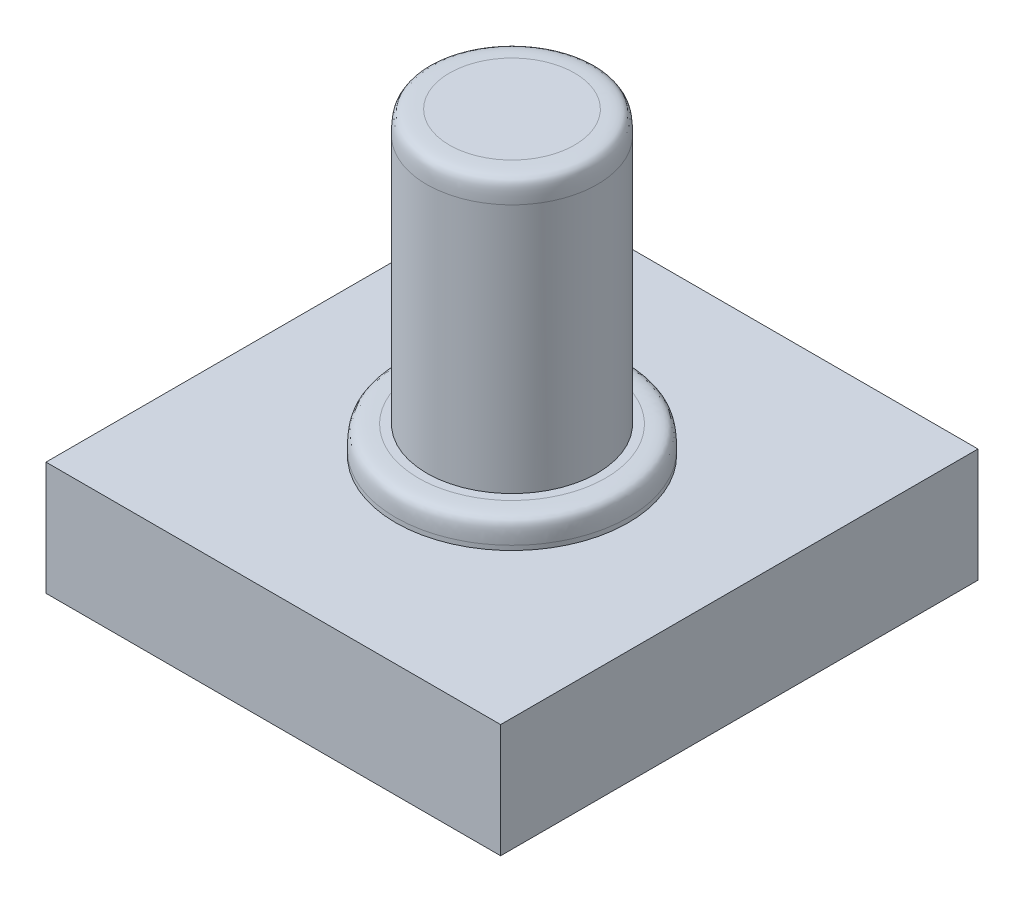
ISO-10303-21;
HEADER;
FILE_DESCRIPTION(('STEP AP214'),'2;1');
FILE_NAME('part.step','',(''),(''),'','','');
FILE_SCHEMA(('AUTOMOTIVE_DESIGN { 1 0 10303 214 1 1 1 1 }'));
ENDSEC;
DATA;
#1=APPLICATION_CONTEXT('core data for automotive mechanical design processes');
#2=APPLICATION_PROTOCOL_DEFINITION('international standard','automotive_design',2000,#1);
#3=PRODUCT_CONTEXT('',#1,'mechanical');
#4=PRODUCT('Part','Part','',(#3));
#5=PRODUCT_RELATED_PRODUCT_CATEGORY('part','',(#4));
#6=PRODUCT_DEFINITION_FORMATION('','',#4);
#7=PRODUCT_DEFINITION_CONTEXT('part definition',#1,'design');
#8=PRODUCT_DEFINITION('design','',#6,#7);
#9=PRODUCT_DEFINITION_SHAPE('','',#8);
#10=(LENGTH_UNIT() NAMED_UNIT(*) SI_UNIT(.MILLI.,.METRE.));
#11=(NAMED_UNIT(*) PLANE_ANGLE_UNIT() SI_UNIT($,.RADIAN.));
#12=(NAMED_UNIT(*) SI_UNIT($,.STERADIAN.) SOLID_ANGLE_UNIT());
#13=UNCERTAINTY_MEASURE_WITH_UNIT(LENGTH_MEASURE(1.E-05),#10,'distance_accuracy_value','');
#14=(GEOMETRIC_REPRESENTATION_CONTEXT(3) GLOBAL_UNCERTAINTY_ASSIGNED_CONTEXT((#13)) GLOBAL_UNIT_ASSIGNED_CONTEXT((#10,
#11,#12)) REPRESENTATION_CONTEXT('',''));
#15=CARTESIAN_POINT('',(0.,0.,0.));
#16=DIRECTION('',(0.,0.,1.));
#17=DIRECTION('',(1.,0.,0.));
#18=AXIS2_PLACEMENT_3D('',#15,#16,#17);
#19=CARTESIAN_POINT('',(-5.,2.5,-5.25));
#20=DIRECTION('',(1.,0.,0.));
#21=DIRECTION('',(0.,0.,-1.));
#22=AXIS2_PLACEMENT_3D('',#19,#20,#21);
#23=PLANE('',#22);
#24=DIRECTION('',(0.,0.,1.));
#25=VECTOR('',#24,1.);
#26=CARTESIAN_POINT('',(-5.,0.,-5.25));
#27=LINE('',#26,#25);
#28=CARTESIAN_POINT('',(-5.,0.,-5.25));
#29=VERTEX_POINT('',#28);
#30=CARTESIAN_POINT('',(-5.,0.,5.25));
#31=VERTEX_POINT('',#30);
#32=EDGE_CURVE('E116',#29,#31,#27,.T.);
#33=ORIENTED_EDGE('',*,*,#32,.T.);
#34=DIRECTION('',(0.,-1.,0.));
#35=VECTOR('',#34,1.);
#36=CARTESIAN_POINT('',(-5.,2.5,5.25));
#37=LINE('',#36,#35);
#38=CARTESIAN_POINT('',(-5.,2.5,5.25));
#39=VERTEX_POINT('',#38);
#40=EDGE_CURVE('E108',#39,#31,#37,.T.);
#41=ORIENTED_EDGE('',*,*,#40,.F.);
#42=DIRECTION('',(0.,0.,1.));
#43=VECTOR('',#42,1.);
#44=CARTESIAN_POINT('',(-5.,2.5,-5.25));
#45=LINE('',#44,#43);
#46=CARTESIAN_POINT('',(-5.,2.5,-5.25));
#47=VERTEX_POINT('',#46);
#48=EDGE_CURVE('E99',#47,#39,#45,.T.);
#49=ORIENTED_EDGE('',*,*,#48,.F.);
#50=DIRECTION('',(0.,-1.,0.));
#51=VECTOR('',#50,1.);
#52=CARTESIAN_POINT('',(-5.,2.5,-5.25));
#53=LINE('',#52,#51);
#54=EDGE_CURVE('E65',#47,#29,#53,.T.);
#55=ORIENTED_EDGE('',*,*,#54,.T.);
#56=EDGE_LOOP('',(#33,#41,#49,#55));
#57=FACE_BOUND('',#56,.T.);
#58=ADVANCED_FACE('F42',(#57),#23,.F.);
#59=CARTESIAN_POINT('',(-5.,2.5,5.25));
#60=DIRECTION('',(0.,0.,-1.));
#61=DIRECTION('',(-1.,0.,0.));
#62=AXIS2_PLACEMENT_3D('',#59,#60,#61);
#63=PLANE('',#62);
#64=DIRECTION('',(1.,0.,0.));
#65=VECTOR('',#64,1.);
#66=CARTESIAN_POINT('',(-5.,0.,5.25));
#67=LINE('',#66,#65);
#68=CARTESIAN_POINT('',(5.,0.,5.25));
#69=VERTEX_POINT('',#68);
#70=EDGE_CURVE('E105',#31,#69,#67,.T.);
#71=ORIENTED_EDGE('',*,*,#70,.T.);
#72=DIRECTION('',(0.,-1.,0.));
#73=VECTOR('',#72,1.);
#74=CARTESIAN_POINT('',(5.,2.5,5.25));
#75=LINE('',#74,#73);
#76=CARTESIAN_POINT('',(5.,2.5,5.25));
#77=VERTEX_POINT('',#76);
#78=EDGE_CURVE('E103',#77,#69,#75,.T.);
#79=ORIENTED_EDGE('',*,*,#78,.F.);
#80=DIRECTION('',(1.,0.,0.));
#81=VECTOR('',#80,1.);
#82=CARTESIAN_POINT('',(-5.,2.5,5.25));
#83=LINE('',#82,#81);
#84=EDGE_CURVE('E91',#39,#77,#83,.T.);
#85=ORIENTED_EDGE('',*,*,#84,.F.);
#86=ORIENTED_EDGE('',*,*,#40,.T.);
#87=EDGE_LOOP('',(#71,#79,#85,#86));
#88=FACE_BOUND('',#87,.T.);
#89=ADVANCED_FACE('F104',(#88),#63,.F.);
#90=CARTESIAN_POINT('',(5.,2.5,-5.25));
#91=DIRECTION('',(1.,0.,0.));
#92=DIRECTION('',(0.,0.,-1.));
#93=AXIS2_PLACEMENT_3D('',#90,#91,#92);
#94=PLANE('',#93);
#95=DIRECTION('',(0.,0.,1.));
#96=VECTOR('',#95,1.);
#97=CARTESIAN_POINT('',(5.,0.,-5.25));
#98=LINE('',#97,#96);
#99=CARTESIAN_POINT('',(5.,0.,-5.25));
#100=VERTEX_POINT('',#99);
#101=EDGE_CURVE('E120',#100,#69,#98,.T.);
#102=ORIENTED_EDGE('',*,*,#101,.F.);
#103=DIRECTION('',(0.,-1.,0.));
#104=VECTOR('',#103,1.);
#105=CARTESIAN_POINT('',(5.,2.5,-5.25));
#106=LINE('',#105,#104);
#107=CARTESIAN_POINT('',(5.,2.5,-5.25));
#108=VERTEX_POINT('',#107);
#109=EDGE_CURVE('E79',#108,#100,#106,.T.);
#110=ORIENTED_EDGE('',*,*,#109,.F.);
#111=DIRECTION('',(0.,0.,1.));
#112=VECTOR('',#111,1.);
#113=CARTESIAN_POINT('',(5.,2.5,-5.25));
#114=LINE('',#113,#112);
#115=EDGE_CURVE('E98',#108,#77,#114,.T.);
#116=ORIENTED_EDGE('',*,*,#115,.T.);
#117=ORIENTED_EDGE('',*,*,#78,.T.);
#118=EDGE_LOOP('',(#102,#110,#116,#117));
#119=FACE_BOUND('',#118,.T.);
#120=ADVANCED_FACE('F110',(#119),#94,.T.);
#121=CARTESIAN_POINT('',(-5.,2.5,-5.25));
#122=DIRECTION('',(0.,0.,-1.));
#123=DIRECTION('',(-1.,0.,0.));
#124=AXIS2_PLACEMENT_3D('',#121,#122,#123);
#125=PLANE('',#124);
#126=DIRECTION('',(1.,0.,0.));
#127=VECTOR('',#126,1.);
#128=CARTESIAN_POINT('',(-5.,0.,-5.25));
#129=LINE('',#128,#127);
#130=EDGE_CURVE('E122',#29,#100,#129,.T.);
#131=ORIENTED_EDGE('',*,*,#130,.F.);
#132=ORIENTED_EDGE('',*,*,#54,.F.);
#133=DIRECTION('',(1.,0.,0.));
#134=VECTOR('',#133,1.);
#135=CARTESIAN_POINT('',(-5.,2.5,-5.25));
#136=LINE('',#135,#134);
#137=EDGE_CURVE('E111',#47,#108,#136,.T.);
#138=ORIENTED_EDGE('',*,*,#137,.T.);
#139=ORIENTED_EDGE('',*,*,#109,.T.);
#140=EDGE_LOOP('',(#131,#132,#138,#139));
#141=FACE_BOUND('',#140,.T.);
#142=ADVANCED_FACE('F270',(#141),#125,.T.);
#143=CARTESIAN_POINT('',(0.,2.5,0.));
#144=DIRECTION('',(0.,1.,0.));
#145=DIRECTION('',(0.,0.,1.));
#146=AXIS2_PLACEMENT_3D('',#143,#144,#145);
#147=PLANE('',#146);
#148=CARTESIAN_POINT('',(0.,2.5,0.));
#149=DIRECTION('',(0.,1.,0.));
#150=DIRECTION('',(0.,0.,1.));
#151=AXIS2_PLACEMENT_3D('',#148,#149,#150);
#152=CIRCLE('',#151,2.56);
#153=CARTESIAN_POINT('',(0.,2.5,2.56));
#154=VERTEX_POINT('',#153);
#155=EDGE_CURVE('E128',#154,#154,#152,.T.);
#156=ORIENTED_EDGE('',*,*,#155,.F.);
#157=EDGE_LOOP('',(#156));
#158=FACE_BOUND('',#157,.T.);
#159=ORIENTED_EDGE('',*,*,#48,.T.);
#160=ORIENTED_EDGE('',*,*,#84,.T.);
#161=ORIENTED_EDGE('',*,*,#115,.F.);
#162=ORIENTED_EDGE('',*,*,#137,.F.);
#163=EDGE_LOOP('',(#159,#160,#161,#162));
#164=FACE_BOUND('',#163,.T.);
#165=ADVANCED_FACE('F95',(#158,#164),#147,.T.);
#166=CARTESIAN_POINT('',(0.,0.,0.));
#167=DIRECTION('',(0.,1.,0.));
#168=DIRECTION('',(0.,0.,1.));
#169=AXIS2_PLACEMENT_3D('',#166,#167,#168);
#170=PLANE('',#169);
#171=ORIENTED_EDGE('',*,*,#32,.F.);
#172=ORIENTED_EDGE('',*,*,#130,.T.);
#173=ORIENTED_EDGE('',*,*,#101,.T.);
#174=ORIENTED_EDGE('',*,*,#70,.F.);
#175=EDGE_LOOP('',(#171,#172,#173,#174));
#176=FACE_BOUND('',#175,.T.);
#177=ADVANCED_FACE('F159',(#176),#170,.F.);
#178=CARTESIAN_POINT('',(0.,3.1,0.));
#179=DIRECTION('',(0.,-1.,0.));
#180=DIRECTION('',(0.,0.,-1.));
#181=AXIS2_PLACEMENT_3D('',#178,#179,#180);
#182=CYLINDRICAL_SURFACE('',#181,2.56);
#183=CARTESIAN_POINT('',(0.,2.6,2.56));
#184=CARTESIAN_POINT('',(0.335103203221805,2.6,2.56));
#185=CARTESIAN_POINT('',(0.670074596119038,2.6,2.49337004723435));
#186=CARTESIAN_POINT('',(1.28926457759022,2.6,2.23689315922344));
#187=CARTESIAN_POINT('',(1.57323961244209,2.6,2.04714710723304));
#188=CARTESIAN_POINT('',(2.04714710723304,2.6,1.57323961244209));
#189=CARTESIAN_POINT('',(2.23689315922345,2.6,1.2892645775902));
#190=CARTESIAN_POINT('',(2.49337004723434,2.6,0.670074596119058));
#191=CARTESIAN_POINT('',(2.56,2.6,0.33510320322179));
#192=CARTESIAN_POINT('',(2.56,2.6,-0.33510320322179));
#193=CARTESIAN_POINT('',(2.49337004723434,2.6,-0.670074596119064));
#194=CARTESIAN_POINT('',(2.23689315922345,2.6,-1.2892645775902));
#195=CARTESIAN_POINT('',(2.047147107233,2.6,-1.57323961244213));
#196=CARTESIAN_POINT('',(1.57323961244212,2.6,-2.047147107233));
#197=CARTESIAN_POINT('',(1.28926457759024,2.6,-2.23689315922343));
#198=CARTESIAN_POINT('',(0.670074596119025,2.6,-2.49337004723435));
#199=CARTESIAN_POINT('',(0.33510320322179,2.6,-2.56));
#200=CARTESIAN_POINT('',(-0.335103203221789,2.6,-2.56));
#201=CARTESIAN_POINT('',(-0.670074596119063,2.6,-2.49337004723434));
#202=CARTESIAN_POINT('',(-1.28926457759019,2.6,-2.23689315922345));
#203=CARTESIAN_POINT('',(-1.57323961244211,2.6,-2.04714710723301));
#204=CARTESIAN_POINT('',(-2.04714710723301,2.6,-1.57323961244211));
#205=CARTESIAN_POINT('',(-2.23689315922344,2.6,-1.28926457759022));
#206=CARTESIAN_POINT('',(-2.49337004723434,2.6,-0.67007459611905));
#207=CARTESIAN_POINT('',(-2.56,2.6,-0.335103203221786));
#208=CARTESIAN_POINT('',(-2.56,2.6,0.335103203221794));
#209=CARTESIAN_POINT('',(-2.49337004723436,2.6,0.670074596119017));
#210=CARTESIAN_POINT('',(-2.23689315922343,2.6,1.28926457759023));
#211=CARTESIAN_POINT('',(-2.04714710723305,2.6,1.57323961244208));
#212=CARTESIAN_POINT('',(-1.57323961244209,2.6,2.04714710723304));
#213=CARTESIAN_POINT('',(-1.28926457759022,2.6,2.23689315922344));
#214=CARTESIAN_POINT('',(-0.67007459611905,2.6,2.49337004723434));
#215=CARTESIAN_POINT('',(-0.335103203221806,2.6,2.56));
#216=CARTESIAN_POINT('',(0.,2.6,2.56));
#217=(BOUNDED_CURVE() B_SPLINE_CURVE(3,(#183,#184,#185,#186,#187,#188,#189,#190,#191,#192,#193,
#194,#195,#196,#197,#198,#199,#200,#201,#202,#203,#204,#205,#206,#207,#208,#209,#210,#211,#212,
#213,#214,#215,#216),.UNSPECIFIED.,.T.,.F.) B_SPLINE_CURVE_WITH_KNOTS((4,2,2,2,2,2,2,2,2,2,2,2,
2,2,2,2,4),(0.,0.392699081698724,0.785398163397448,1.17809724509617,1.5707963267949,
1.96349540849362,2.35619449019234,2.74889357189107,3.14159265358979,3.53429173528852,
3.92699081698724,4.31968989868597,4.71238898038469,5.10508806208341,5.49778714378214,
5.89048622548086,6.28318530717959),
.UNSPECIFIED.) CURVE() GEOMETRIC_REPRESENTATION_ITEM() RATIONAL_B_SPLINE_CURVE((1.,1.,1.,1.,1.,
1.,1.,1.,1.,1.,1.,1.,1.,1.,1.,1.,1.,1.,1.,1.,1.,1.,1.,1.,1.,1.,1.,1.,1.,1.,1.,1.,1.,1.)) REPRESENTATION_ITEM(''));
#218=CARTESIAN_POINT('',(0.,2.6,2.56));
#219=VERTEX_POINT('',#218);
#220=EDGE_CURVE('E356',#219,#219,#217,.F.);
#221=ORIENTED_EDGE('',*,*,#220,.T.);
#222=EDGE_LOOP('',(#221));
#223=FACE_BOUND('',#222,.T.);
#224=ORIENTED_EDGE('',*,*,#155,.T.);
#225=EDGE_LOOP('',(#224));
#226=FACE_BOUND('',#225,.T.);
#227=ADVANCED_FACE('F151',(#223,#226),#182,.T.);
#228=CARTESIAN_POINT('',(0.,3.1,0.));
#229=DIRECTION('',(0.,1.,0.));
#230=DIRECTION('',(0.,0.,1.));
#231=AXIS2_PLACEMENT_3D('',#228,#229,#230);
#232=PLANE('',#231);
#233=CARTESIAN_POINT('',(0.,3.1,0.));
#234=DIRECTION('',(0.,1.,0.));
#235=DIRECTION('',(0.,0.,1.));
#236=AXIS2_PLACEMENT_3D('',#233,#234,#235);
#237=CIRCLE('',#236,1.875);
#238=CARTESIAN_POINT('',(0.,3.1,1.875));
#239=VERTEX_POINT('',#238);
#240=EDGE_CURVE('E118',#239,#239,#237,.T.);
#241=ORIENTED_EDGE('',*,*,#240,.F.);
#242=EDGE_LOOP('',(#241));
#243=FACE_BOUND('',#242,.T.);
#244=CARTESIAN_POINT('',(0.,3.1,2.06));
#245=CARTESIAN_POINT('',(-0.269653358842547,3.1,2.06));
#246=CARTESIAN_POINT('',(-0.539200651564551,3.1,2.0063837098839));
#247=CARTESIAN_POINT('',(-1.03745508977962,3.1,1.7999999640626));
#248=CARTESIAN_POINT('',(-1.26596625063697,3.1,1.64731368785157));
#249=CARTESIAN_POINT('',(-1.64731368785161,3.1,1.26596625063699));
#250=CARTESIAN_POINT('',(-1.79999996406261,3.1,1.03745508977963));
#251=CARTESIAN_POINT('',(-2.0063837098839,3.1,0.53920065156453));
#252=CARTESIAN_POINT('',(-2.06,3.1,0.269653358842537));
#253=CARTESIAN_POINT('',(-2.06,3.1,-0.269653358842531));
#254=CARTESIAN_POINT('',(-2.0063837098839,3.1,-0.539200651564551));
#255=CARTESIAN_POINT('',(-1.7999999640626,3.1,-1.03745508977962));
#256=CARTESIAN_POINT('',(-1.64731368785155,3.1,-1.265966250637));
#257=CARTESIAN_POINT('',(-1.26596625063703,3.1,-1.64731368785158));
#258=CARTESIAN_POINT('',(-1.03745508977962,3.1,-1.79999996406263));
#259=CARTESIAN_POINT('',(-0.539200651564545,3.1,-2.00638370988387));
#260=CARTESIAN_POINT('',(-0.269653358842534,3.1,-2.06));
#261=CARTESIAN_POINT('',(0.269653358842534,3.1,-2.06));
#262=CARTESIAN_POINT('',(0.539200651564551,3.1,-2.0063837098839));
#263=CARTESIAN_POINT('',(1.03745508977962,3.1,-1.7999999640626));
#264=CARTESIAN_POINT('',(1.26596625063703,3.1,-1.64731368785158));
#265=CARTESIAN_POINT('',(1.64731368785155,3.1,-1.265966250637));
#266=CARTESIAN_POINT('',(1.79999996406262,3.1,-1.03745508977963));
#267=CARTESIAN_POINT('',(2.00638370988388,3.1,-0.539200651564546));
#268=CARTESIAN_POINT('',(2.06,3.1,-0.269653358842534));
#269=CARTESIAN_POINT('',(2.06,3.1,0.269653358842534));
#270=CARTESIAN_POINT('',(2.00638370988385,3.1,0.539200651564544));
#271=CARTESIAN_POINT('',(1.79999996406265,3.1,1.03745508977962));
#272=CARTESIAN_POINT('',(1.64731368785161,3.1,1.265966250637));
#273=CARTESIAN_POINT('',(1.26596625063697,3.1,1.64731368785158));
#274=CARTESIAN_POINT('',(1.03745508977962,3.1,1.79999996406262));
#275=CARTESIAN_POINT('',(0.539200651564545,3.1,2.00638370988388));
#276=CARTESIAN_POINT('',(0.269653358842546,3.1,2.06));
#277=CARTESIAN_POINT('',(0.,3.1,2.06));
#278=(BOUNDED_CURVE() B_SPLINE_CURVE(3,(#244,#245,#246,#247,#248,#249,#250,#251,#252,#253,#254,
#255,#256,#257,#258,#259,#260,#261,#262,#263,#264,#265,#266,#267,#268,#269,#270,#271,#272,#273,
#274,#275,#276,#277),.UNSPECIFIED.,.T.,.F.) B_SPLINE_CURVE_WITH_KNOTS((4,2,2,2,2,2,2,2,2,2,2,2,
2,2,2,2,4),(0.,0.392699081698725,0.785398163397448,1.17809724509617,1.5707963267949,
1.96349540849362,2.35619449019234,2.74889357189107,3.14159265358979,3.53429173528852,
3.92699081698724,4.31968989868597,4.71238898038469,5.10508806208341,5.49778714378214,
5.89048622548086,6.28318530717959),
.UNSPECIFIED.) CURVE() GEOMETRIC_REPRESENTATION_ITEM() RATIONAL_B_SPLINE_CURVE((1.,1.,1.,1.,1.,
1.,1.,1.,1.,1.,1.,1.,1.,1.,1.,1.,1.,1.,1.,1.,1.,1.,1.,1.,1.,1.,1.,1.,1.,1.,1.,1.,1.,1.)) REPRESENTATION_ITEM(''));
#279=CARTESIAN_POINT('',(0.,3.1,2.06));
#280=VERTEX_POINT('',#279);
#281=EDGE_CURVE('E133',#280,#280,#278,.F.);
#282=ORIENTED_EDGE('',*,*,#281,.T.);
#283=EDGE_LOOP('',(#282));
#284=FACE_BOUND('',#283,.T.);
#285=ADVANCED_FACE('F140',(#243,#284),#232,.T.);
#286=CARTESIAN_POINT('',(0.,3.1,2.06));
#287=CARTESIAN_POINT('',(0.269653358842546,3.1,2.06));
#288=CARTESIAN_POINT('',(0.539200651564545,3.1,2.00638370988388));
#289=CARTESIAN_POINT('',(1.03745508977962,3.1,1.79999996406262));
#290=CARTESIAN_POINT('',(1.26596625063697,3.1,1.64731368785158));
#291=CARTESIAN_POINT('',(1.64731368785161,3.1,1.265966250637));
#292=CARTESIAN_POINT('',(1.79999996406265,3.1,1.03745508977962));
#293=CARTESIAN_POINT('',(2.00638370988385,3.1,0.539200651564544));
#294=CARTESIAN_POINT('',(2.06,3.1,0.269653358842534));
#295=CARTESIAN_POINT('',(2.06,3.1,-0.269653358842534));
#296=CARTESIAN_POINT('',(2.00638370988388,3.1,-0.539200651564546));
#297=CARTESIAN_POINT('',(1.79999996406262,3.1,-1.03745508977963));
#298=CARTESIAN_POINT('',(1.64731368785155,3.1,-1.265966250637));
#299=CARTESIAN_POINT('',(1.26596625063703,3.1,-1.64731368785158));
#300=CARTESIAN_POINT('',(1.03745508977962,3.1,-1.7999999640626));
#301=CARTESIAN_POINT('',(0.539200651564551,3.1,-2.0063837098839));
#302=CARTESIAN_POINT('',(0.269653358842534,3.1,-2.06));
#303=CARTESIAN_POINT('',(-0.269653358842534,3.1,-2.06));
#304=CARTESIAN_POINT('',(-0.539200651564545,3.1,-2.00638370988387));
#305=CARTESIAN_POINT('',(-1.03745508977962,3.1,-1.79999996406263));
#306=CARTESIAN_POINT('',(-1.26596625063703,3.1,-1.64731368785158));
#307=CARTESIAN_POINT('',(-1.64731368785155,3.1,-1.265966250637));
#308=CARTESIAN_POINT('',(-1.7999999640626,3.1,-1.03745508977962));
#309=CARTESIAN_POINT('',(-2.0063837098839,3.1,-0.539200651564551));
#310=CARTESIAN_POINT('',(-2.06,3.1,-0.269653358842531));
#311=CARTESIAN_POINT('',(-2.06,3.1,0.269653358842537));
#312=CARTESIAN_POINT('',(-2.0063837098839,3.1,0.53920065156453));
#313=CARTESIAN_POINT('',(-1.79999996406261,3.1,1.03745508977963));
#314=CARTESIAN_POINT('',(-1.64731368785161,3.1,1.26596625063699));
#315=CARTESIAN_POINT('',(-1.26596625063697,3.1,1.64731368785157));
#316=CARTESIAN_POINT('',(-1.03745508977962,3.1,1.7999999640626));
#317=CARTESIAN_POINT('',(-0.539200651564551,3.1,2.0063837098839));
#318=CARTESIAN_POINT('',(-0.269653358842547,3.1,2.06));
#319=CARTESIAN_POINT('',(0.,3.1,2.06));
#320=CARTESIAN_POINT('',(0.,3.1,2.56));
#321=CARTESIAN_POINT('',(0.335103203221805,3.1,2.56));
#322=CARTESIAN_POINT('',(0.670074596119029,3.1,2.49337004723433));
#323=CARTESIAN_POINT('',(1.28926457759023,3.1,2.23689315922346));
#324=CARTESIAN_POINT('',(1.57323961244207,3.1,2.04714710723302));
#325=CARTESIAN_POINT('',(2.04714710723305,3.1,1.5732396124421));
#326=CARTESIAN_POINT('',(2.23689315922352,3.10000000000006,1.28926457759023));
#327=CARTESIAN_POINT('',(2.49337004723427,3.09999999999994,0.670074596119028));
#328=CARTESIAN_POINT('',(2.56,3.1,0.33510320322179));
#329=CARTESIAN_POINT('',(2.56,3.1,-0.33510320322179));
#330=CARTESIAN_POINT('',(2.49337004723433,3.09999999999994,-0.670074596119059));
#331=CARTESIAN_POINT('',(2.23689315922346,3.10000000000006,-1.2892645775902));
#332=CARTESIAN_POINT('',(2.04714710723298,3.1,-1.57323961244208));
#333=CARTESIAN_POINT('',(1.57323961244214,3.1,-2.04714710723304));
#334=CARTESIAN_POINT('',(1.28926457759023,3.09999999999994,-2.2368931592234));
#335=CARTESIAN_POINT('',(0.670074596119037,3.10000000000006,-2.49337004723438));
#336=CARTESIAN_POINT('',(0.33510320322179,3.1,-2.56));
#337=CARTESIAN_POINT('',(-0.335103203221789,3.1,-2.56));
#338=CARTESIAN_POINT('',(-0.670074596119059,3.1,-2.49337004723433));
#339=CARTESIAN_POINT('',(-1.28926457759019,3.1,-2.23689315922346));
#340=CARTESIAN_POINT('',(-1.57323961244211,3.1,-2.04714710723307));
#341=CARTESIAN_POINT('',(-2.04714710723301,3.1,-1.57323961244205));
#342=CARTESIAN_POINT('',(-2.2368931592234,3.09999999999994,-1.2892645775902));
#343=CARTESIAN_POINT('',(-2.49337004723438,3.10000000000006,-0.670074596119066));
#344=CARTESIAN_POINT('',(-2.56,3.1,-0.335103203221786));
#345=CARTESIAN_POINT('',(-2.56,3.1,0.335103203221794));
#346=CARTESIAN_POINT('',(-2.49337004723439,3.10000000000006,0.670074596119059));
#347=CARTESIAN_POINT('',(-2.2368931592234,3.09999999999994,1.28926457759019));
#348=CARTESIAN_POINT('',(-2.04714710723308,3.1,1.57323961244208));
#349=CARTESIAN_POINT('',(-1.57323961244206,3.1,2.04714710723304));
#350=CARTESIAN_POINT('',(-1.2892645775902,3.09999999999994,2.2368931592234));
#351=CARTESIAN_POINT('',(-0.670074596119066,3.10000000000006,2.49337004723438));
#352=CARTESIAN_POINT('',(-0.335103203221806,3.1,2.56));
#353=CARTESIAN_POINT('',(0.,3.1,2.56));
#354=CARTESIAN_POINT('',(0.,2.6,2.56));
#355=CARTESIAN_POINT('',(0.335103203221805,2.6,2.56));
#356=CARTESIAN_POINT('',(0.670074596119038,2.6,2.49337004723435));
#357=CARTESIAN_POINT('',(1.28926457759022,2.6,2.23689315922344));
#358=CARTESIAN_POINT('',(1.57323961244209,2.6,2.04714710723304));
#359=CARTESIAN_POINT('',(2.04714710723304,2.6,1.57323961244209));
#360=CARTESIAN_POINT('',(2.23689315922345,2.6,1.2892645775902));
#361=CARTESIAN_POINT('',(2.49337004723434,2.6,0.670074596119058));
#362=CARTESIAN_POINT('',(2.56,2.6,0.33510320322179));
#363=CARTESIAN_POINT('',(2.56,2.6,-0.33510320322179));
#364=CARTESIAN_POINT('',(2.49337004723434,2.6,-0.670074596119064));
#365=CARTESIAN_POINT('',(2.23689315922345,2.6,-1.2892645775902));
#366=CARTESIAN_POINT('',(2.047147107233,2.6,-1.57323961244213));
#367=CARTESIAN_POINT('',(1.57323961244212,2.6,-2.047147107233));
#368=CARTESIAN_POINT('',(1.28926457759024,2.6,-2.23689315922343));
#369=CARTESIAN_POINT('',(0.670074596119025,2.6,-2.49337004723435));
#370=CARTESIAN_POINT('',(0.33510320322179,2.6,-2.56));
#371=CARTESIAN_POINT('',(-0.335103203221789,2.6,-2.56));
#372=CARTESIAN_POINT('',(-0.670074596119063,2.6,-2.49337004723434));
#373=CARTESIAN_POINT('',(-1.28926457759019,2.6,-2.23689315922345));
#374=CARTESIAN_POINT('',(-1.57323961244211,2.6,-2.04714710723301));
#375=CARTESIAN_POINT('',(-2.04714710723301,2.6,-1.57323961244211));
#376=CARTESIAN_POINT('',(-2.23689315922344,2.6,-1.28926457759022));
#377=CARTESIAN_POINT('',(-2.49337004723434,2.6,-0.67007459611905));
#378=CARTESIAN_POINT('',(-2.56,2.6,-0.335103203221786));
#379=CARTESIAN_POINT('',(-2.56,2.6,0.335103203221794));
#380=CARTESIAN_POINT('',(-2.49337004723436,2.6,0.670074596119017));
#381=CARTESIAN_POINT('',(-2.23689315922343,2.6,1.28926457759023));
#382=CARTESIAN_POINT('',(-2.04714710723305,2.6,1.57323961244208));
#383=CARTESIAN_POINT('',(-1.57323961244209,2.6,2.04714710723304));
#384=CARTESIAN_POINT('',(-1.28926457759022,2.6,2.23689315922344));
#385=CARTESIAN_POINT('',(-0.67007459611905,2.6,2.49337004723434));
#386=CARTESIAN_POINT('',(-0.335103203221806,2.6,2.56));
#387=CARTESIAN_POINT('',(0.,2.6,2.56));
#388=(BOUNDED_SURFACE() B_SPLINE_SURFACE(2,3,((#286,#287,#288,#289,#290,#291,#292,#293,#294,
#295,#296,#297,#298,#299,#300,#301,#302,#303,#304,#305,#306,#307,#308,#309,#310,#311,#312,#313,
#314,#315,#316,#317,#318,#319),(#320,#321,#322,#323,#324,#325,#326,#327,#328,#329,#330,#331,
#332,#333,#334,#335,#336,#337,#338,#339,#340,#341,#342,#343,#344,#345,#346,#347,#348,#349,#350,
#351,#352,#353),(#354,#355,#356,#357,#358,#359,#360,#361,#362,#363,#364,#365,#366,#367,#368,
#369,#370,#371,#372,#373,#374,#375,#376,#377,#378,#379,#380,#381,#382,#383,#384,#385,#386,
#387)),.UNSPECIFIED.,.F.,.T.,.F.) B_SPLINE_SURFACE_WITH_KNOTS((3,3),(4,2,2,2,2,2,2,2,2,2,2,2,2,
2,2,2,4),(0.,1.),(0.,0.392699081698724,0.785398163397448,1.17809724509617,1.5707963267949,
1.96349540849362,2.35619449019234,2.74889357189107,3.14159265358979,3.53429173528852,
3.92699081698724,4.31968989868597,4.71238898038469,5.10508806208341,5.49778714378214,
5.89048622548086,6.28318530717959),
.UNSPECIFIED.) GEOMETRIC_REPRESENTATION_ITEM() RATIONAL_B_SPLINE_SURFACE(((1.,1.,1.,1.,1.,1.,1.,
1.,1.,1.,1.,1.,1.,1.,1.,1.,1.,1.,1.,1.,1.,1.,1.,1.,1.,1.,1.,1.,1.,1.,1.,1.,1.,1.),
(2.33333333333333,2.33333333333333,2.33333333333333,2.33333333333333,2.33333333333333,
2.33333333333333,2.33333333333333,2.33333333333333,2.33333333333333,2.33333333333333,
2.33333333333333,2.33333333333333,2.33333333333333,2.33333333333333,2.33333333333333,
2.33333333333333,2.33333333333333,2.33333333333333,2.33333333333333,2.33333333333333,
2.33333333333333,2.33333333333333,2.33333333333333,2.33333333333333,2.33333333333333,
2.33333333333333,2.33333333333333,2.33333333333333,2.33333333333333,2.33333333333333,
2.33333333333333,2.33333333333333,2.33333333333333,2.33333333333333),(1.,1.,1.,1.,1.,1.,1.,1.,
1.,1.,1.,1.,1.,1.,1.,1.,1.,1.,1.,1.,1.,1.,1.,1.,1.,1.,1.,1.,1.,1.,1.,1.,1.,1.))) REPRESENTATION_ITEM('') SURFACE());
#389=ORIENTED_EDGE('',*,*,#220,.F.);
#390=EDGE_LOOP('',(#389));
#391=FACE_BOUND('',#390,.T.);
#392=ORIENTED_EDGE('',*,*,#281,.F.);
#393=EDGE_LOOP('',(#392));
#394=FACE_BOUND('',#393,.T.);
#395=ADVANCED_FACE('F150',(#391,#394),#388,.T.);
#396=CARTESIAN_POINT('',(0.,9.1,0.));
#397=DIRECTION('',(0.,-1.,0.));
#398=DIRECTION('',(0.,0.,-1.));
#399=AXIS2_PLACEMENT_3D('',#396,#397,#398);
#400=CYLINDRICAL_SURFACE('',#399,1.875);
#401=CARTESIAN_POINT('',(0.,8.6,1.875));
#402=CARTESIAN_POINT('',(0.2454369044255,8.6,1.875));
#403=CARTESIAN_POINT('',(0.490777303163002,8.6,1.82619876047323));
#404=CARTESIAN_POINT('',(0.944285568206085,8.6,1.63834948644409));
#405=CARTESIAN_POINT('',(1.15227511525216,8.6,1.4993753141974));
#406=CARTESIAN_POINT('',(1.4993753141974,8.6,1.15227511525216));
#407=CARTESIAN_POINT('',(1.63834948644409,8.6,0.94428556820609));
#408=CARTESIAN_POINT('',(1.82619876047323,8.6,0.490777303162995));
#409=CARTESIAN_POINT('',(1.875,8.6,0.24543690442539));
#410=CARTESIAN_POINT('',(1.875,8.6,-0.24543690442539));
#411=CARTESIAN_POINT('',(1.82619876047323,8.6,-0.490777303162995));
#412=CARTESIAN_POINT('',(1.63834948644409,8.6,-0.944285568206093));
#413=CARTESIAN_POINT('',(1.4993753141974,8.6,-1.15227511525215));
#414=CARTESIAN_POINT('',(1.15227511525215,8.6,-1.49937531419741));
#415=CARTESIAN_POINT('',(0.944285568206093,8.6,-1.63834948644409));
#416=CARTESIAN_POINT('',(0.490777303162998,8.6,-1.82619876047323));
#417=CARTESIAN_POINT('',(0.24543690442539,8.6,-1.875));
#418=CARTESIAN_POINT('',(-0.24543690442539,8.6,-1.875));
#419=CARTESIAN_POINT('',(-0.490777303162983,8.6,-1.82619876047324));
#420=CARTESIAN_POINT('',(-0.944285568206098,8.6,-1.63834948644409));
#421=CARTESIAN_POINT('',(-1.15227511525216,8.6,-1.49937531419739));
#422=CARTESIAN_POINT('',(-1.4993753141974,8.6,-1.15227511525216));
#423=CARTESIAN_POINT('',(-1.6383494864441,8.6,-0.944285568206078));
#424=CARTESIAN_POINT('',(-1.82619876047323,8.6,-0.490777303163013));
#425=CARTESIAN_POINT('',(-1.875,8.6,-0.245436904425387));
#426=CARTESIAN_POINT('',(-1.875,8.6,0.245436904425393));
#427=CARTESIAN_POINT('',(-1.82619876047323,8.6,0.490777303162993));
#428=CARTESIAN_POINT('',(-1.63834948644409,8.6,0.944285568206089));
#429=CARTESIAN_POINT('',(-1.49937531419741,8.6,1.15227511525214));
#430=CARTESIAN_POINT('',(-1.15227511525215,8.6,1.4993753141974));
#431=CARTESIAN_POINT('',(-0.944285568206078,8.6,1.6383494864441));
#432=CARTESIAN_POINT('',(-0.490777303163013,8.6,1.82619876047323));
#433=CARTESIAN_POINT('',(-0.2454369044255,8.6,1.875));
#434=CARTESIAN_POINT('',(0.,8.6,1.875));
#435=(BOUNDED_CURVE() B_SPLINE_CURVE(3,(#401,#402,#403,#404,#405,#406,#407,#408,#409,#410,#411,
#412,#413,#414,#415,#416,#417,#418,#419,#420,#421,#422,#423,#424,#425,#426,#427,#428,#429,#430,
#431,#432,#433,#434),.UNSPECIFIED.,.T.,.F.) B_SPLINE_CURVE_WITH_KNOTS((4,2,2,2,2,2,2,2,2,2,2,2,
2,2,2,2,4),(0.,0.392699081698724,0.785398163397448,1.17809724509617,1.5707963267949,
1.96349540849362,2.35619449019234,2.74889357189107,3.14159265358979,3.53429173528852,
3.92699081698724,4.31968989868597,4.71238898038469,5.10508806208341,5.49778714378214,
5.89048622548086,6.28318530717959),
.UNSPECIFIED.) CURVE() GEOMETRIC_REPRESENTATION_ITEM() RATIONAL_B_SPLINE_CURVE((1.,1.,1.,1.,1.,
1.,1.,1.,1.,1.,1.,1.,1.,1.,1.,1.,1.,1.,1.,1.,1.,1.,1.,1.,1.,1.,1.,1.,1.,1.,1.,1.,1.,1.)) REPRESENTATION_ITEM(''));
#436=CARTESIAN_POINT('',(0.,8.6,1.875));
#437=VERTEX_POINT('',#436);
#438=EDGE_CURVE('E12',#437,#437,#435,.F.);
#439=ORIENTED_EDGE('',*,*,#438,.T.);
#440=EDGE_LOOP('',(#439));
#441=FACE_BOUND('',#440,.T.);
#442=ORIENTED_EDGE('',*,*,#240,.T.);
#443=EDGE_LOOP('',(#442));
#444=FACE_BOUND('',#443,.T.);
#445=ADVANCED_FACE('F153',(#441,#444),#400,.T.);
#446=CARTESIAN_POINT('',(0.,9.1,0.));
#447=DIRECTION('',(0.,1.,0.));
#448=DIRECTION('',(0.,0.,1.));
#449=AXIS2_PLACEMENT_3D('',#446,#447,#448);
#450=PLANE('',#449);
#451=CARTESIAN_POINT('',(0.,9.1,1.375));
#452=CARTESIAN_POINT('',(-0.179987063245367,9.1,1.375));
#453=CARTESIAN_POINT('',(-0.35990335565287,9.1,1.33921242434702));
#454=CARTESIAN_POINT('',(-0.692476083351131,9.1,1.20145629005901));
#455=CARTESIAN_POINT('',(-0.84500175118491,9.1,1.0995418970781));
#456=CARTESIAN_POINT('',(-1.0995418970781,9.1,0.845001751184905));
#457=CARTESIAN_POINT('',(-1.20145629005901,9.1,0.692476083351127));
#458=CARTESIAN_POINT('',(-1.33921242434703,9.1,0.359903355652866));
#459=CARTESIAN_POINT('',(-1.375,9.1,0.179987063245288));
#460=CARTESIAN_POINT('',(-1.375,9.1,-0.179987063245284));
#461=CARTESIAN_POINT('',(-1.33921242434702,9.1,-0.35990335565287));
#462=CARTESIAN_POINT('',(-1.20145629005901,9.1,-0.692476083351131));
#463=CARTESIAN_POINT('',(-1.0995418970781,9.1,-0.845001751184917));
#464=CARTESIAN_POINT('',(-0.845001751184908,9.1,-1.09954189707809));
#465=CARTESIAN_POINT('',(-0.692476083351141,9.1,-1.20145629005899));
#466=CARTESIAN_POINT('',(-0.359903355652852,9.1,-1.33921242434705));
#467=CARTESIAN_POINT('',(-0.179987063245286,9.1,-1.375));
#468=CARTESIAN_POINT('',(0.179987063245286,9.1,-1.375));
#469=CARTESIAN_POINT('',(0.359903355652866,9.1,-1.33921242434705));
#470=CARTESIAN_POINT('',(0.692476083351135,9.1,-1.20145629005899));
#471=CARTESIAN_POINT('',(0.845001751184897,9.1,-1.09954189707809));
#472=CARTESIAN_POINT('',(1.09954189707811,9.1,-0.845001751184918));
#473=CARTESIAN_POINT('',(1.20145629005899,9.1,-0.692476083351133));
#474=CARTESIAN_POINT('',(1.33921242434705,9.1,-0.359903355652864));
#475=CARTESIAN_POINT('',(1.375,9.1,-0.179987063245286));
#476=CARTESIAN_POINT('',(1.375,9.1,0.179987063245286));
#477=CARTESIAN_POINT('',(1.33921242434705,9.1,0.359903355652863));
#478=CARTESIAN_POINT('',(1.20145629005899,9.1,0.692476083351132));
#479=CARTESIAN_POINT('',(1.0995418970781,9.1,0.845001751184917));
#480=CARTESIAN_POINT('',(0.845001751184908,9.1,1.09954189707809));
#481=CARTESIAN_POINT('',(0.69247608335114,9.1,1.20145629005902));
#482=CARTESIAN_POINT('',(0.359903355652857,9.1,1.33921242434702));
#483=CARTESIAN_POINT('',(0.179987063245366,9.1,1.375));
#484=CARTESIAN_POINT('',(0.,9.1,1.375));
#485=(BOUNDED_CURVE() B_SPLINE_CURVE(3,(#451,#452,#453,#454,#455,#456,#457,#458,#459,#460,#461,
#462,#463,#464,#465,#466,#467,#468,#469,#470,#471,#472,#473,#474,#475,#476,#477,#478,#479,#480,
#481,#482,#483,#484),.UNSPECIFIED.,.T.,.F.) B_SPLINE_CURVE_WITH_KNOTS((4,2,2,2,2,2,2,2,2,2,2,2,
2,2,2,2,4),(0.,0.392699081698725,0.785398163397448,1.17809724509617,1.5707963267949,
1.96349540849362,2.35619449019234,2.74889357189107,3.14159265358979,3.53429173528852,
3.92699081698724,4.31968989868597,4.71238898038469,5.10508806208341,5.49778714378214,
5.89048622548086,6.28318530717959),
.UNSPECIFIED.) CURVE() GEOMETRIC_REPRESENTATION_ITEM() RATIONAL_B_SPLINE_CURVE((1.,1.,1.,1.,1.,
1.,1.,1.,1.,1.,1.,1.,1.,1.,1.,1.,1.,1.,1.,1.,1.,1.,1.,1.,1.,1.,1.,1.,1.,1.,1.,1.,1.,1.)) REPRESENTATION_ITEM(''));
#486=CARTESIAN_POINT('',(0.,9.1,1.375));
#487=VERTEX_POINT('',#486);
#488=EDGE_CURVE('E57',#487,#487,#485,.F.);
#489=ORIENTED_EDGE('',*,*,#488,.T.);
#490=EDGE_LOOP('',(#489));
#491=FACE_BOUND('',#490,.T.);
#492=ADVANCED_FACE('F251',(#491),#450,.T.);
#493=CARTESIAN_POINT('',(0.,9.1,1.375));
#494=CARTESIAN_POINT('',(0.179987063245366,9.1,1.375));
#495=CARTESIAN_POINT('',(0.359903355652857,9.1,1.33921242434702));
#496=CARTESIAN_POINT('',(0.69247608335114,9.1,1.20145629005902));
#497=CARTESIAN_POINT('',(0.845001751184908,9.1,1.09954189707809));
#498=CARTESIAN_POINT('',(1.0995418970781,9.1,0.845001751184917));
#499=CARTESIAN_POINT('',(1.20145629005899,9.1,0.692476083351132));
#500=CARTESIAN_POINT('',(1.33921242434705,9.1,0.359903355652863));
#501=CARTESIAN_POINT('',(1.375,9.1,0.179987063245286));
#502=CARTESIAN_POINT('',(1.375,9.1,-0.179987063245286));
#503=CARTESIAN_POINT('',(1.33921242434705,9.1,-0.359903355652864));
#504=CARTESIAN_POINT('',(1.20145629005899,9.1,-0.692476083351133));
#505=CARTESIAN_POINT('',(1.09954189707811,9.1,-0.845001751184918));
#506=CARTESIAN_POINT('',(0.845001751184897,9.1,-1.09954189707809));
#507=CARTESIAN_POINT('',(0.692476083351135,9.1,-1.20145629005899));
#508=CARTESIAN_POINT('',(0.359903355652866,9.1,-1.33921242434705));
#509=CARTESIAN_POINT('',(0.179987063245286,9.1,-1.375));
#510=CARTESIAN_POINT('',(-0.179987063245286,9.1,-1.375));
#511=CARTESIAN_POINT('',(-0.359903355652852,9.1,-1.33921242434705));
#512=CARTESIAN_POINT('',(-0.692476083351141,9.1,-1.20145629005899));
#513=CARTESIAN_POINT('',(-0.845001751184908,9.1,-1.09954189707809));
#514=CARTESIAN_POINT('',(-1.0995418970781,9.1,-0.845001751184917));
#515=CARTESIAN_POINT('',(-1.20145629005901,9.1,-0.692476083351131));
#516=CARTESIAN_POINT('',(-1.33921242434702,9.1,-0.35990335565287));
#517=CARTESIAN_POINT('',(-1.375,9.1,-0.179987063245284));
#518=CARTESIAN_POINT('',(-1.375,9.1,0.179987063245288));
#519=CARTESIAN_POINT('',(-1.33921242434703,9.1,0.359903355652866));
#520=CARTESIAN_POINT('',(-1.20145629005901,9.1,0.692476083351127));
#521=CARTESIAN_POINT('',(-1.0995418970781,9.1,0.845001751184905));
#522=CARTESIAN_POINT('',(-0.84500175118491,9.1,1.0995418970781));
#523=CARTESIAN_POINT('',(-0.692476083351131,9.1,1.20145629005901));
#524=CARTESIAN_POINT('',(-0.35990335565287,9.1,1.33921242434702));
#525=CARTESIAN_POINT('',(-0.179987063245367,9.1,1.375));
#526=CARTESIAN_POINT('',(0.,9.1,1.375));
#527=CARTESIAN_POINT('',(0.,9.1,1.875));
#528=CARTESIAN_POINT('',(0.2454369044255,9.1,1.875));
#529=CARTESIAN_POINT('',(0.490777303162991,9.1,1.82619876047321));
#530=CARTESIAN_POINT('',(0.944285568206095,9.1,1.63834948644412));
#531=CARTESIAN_POINT('',(1.15227511525212,9.1,1.49937531419738));
#532=CARTESIAN_POINT('',(1.49937531419743,9.1,1.15227511525218));
#533=CARTESIAN_POINT('',(1.63834948644407,9.1,0.944285568206082));
#534=CARTESIAN_POINT('',(1.82619876047325,9.1,0.490777303163003));
#535=CARTESIAN_POINT('',(1.875,9.1,0.24543690442539));
#536=CARTESIAN_POINT('',(1.875,9.1,-0.24543690442539));
#537=CARTESIAN_POINT('',(1.82619876047323,9.1,-0.490777303162994));
#538=CARTESIAN_POINT('',(1.63834948644409,9.1,-0.944285568206094));
#539=CARTESIAN_POINT('',(1.49937531419743,9.1,-1.1522751152522));
#540=CARTESIAN_POINT('',(1.15227511525212,9.1,-1.49937531419736));
#541=CARTESIAN_POINT('',(0.944285568206086,9.1,-1.63834948644407));
#542=CARTESIAN_POINT('',(0.490777303163006,9.1,-1.82619876047325));
#543=CARTESIAN_POINT('',(0.24543690442539,9.1,-1.875));
#544=CARTESIAN_POINT('',(-0.24543690442539,9.1,-1.875));
#545=CARTESIAN_POINT('',(-0.490777303162981,9.1,-1.82619876047323));
#546=CARTESIAN_POINT('',(-0.9442855682061,9.1,-1.63834948644409));
#547=CARTESIAN_POINT('',(-1.15227511525216,9.1,-1.49937531419739));
#548=CARTESIAN_POINT('',(-1.4993753141974,9.1,-1.15227511525216));
#549=CARTESIAN_POINT('',(-1.63834948644409,9.1,-0.944285568206084));
#550=CARTESIAN_POINT('',(-1.82619876047323,9.1,-0.490777303163008));
#551=CARTESIAN_POINT('',(-1.875,9.1,-0.245436904425387));
#552=CARTESIAN_POINT('',(-1.875,9.1,0.245436904425393));
#553=CARTESIAN_POINT('',(-1.82619876047324,9.1,0.490777303162993));
#554=CARTESIAN_POINT('',(-1.63834948644409,9.1,0.944285568206088));
#555=CARTESIAN_POINT('',(-1.49937531419741,9.1,1.15227511525214));
#556=CARTESIAN_POINT('',(-1.15227511525215,9.1,1.4993753141974));
#557=CARTESIAN_POINT('',(-0.944285568206084,9.1,1.63834948644409));
#558=CARTESIAN_POINT('',(-0.490777303163008,9.1,1.82619876047323));
#559=CARTESIAN_POINT('',(-0.2454369044255,9.1,1.875));
#560=CARTESIAN_POINT('',(0.,9.1,1.875));
#561=CARTESIAN_POINT('',(0.,8.6,1.875));
#562=CARTESIAN_POINT('',(0.2454369044255,8.6,1.875));
#563=CARTESIAN_POINT('',(0.490777303163002,8.6,1.82619876047323));
#564=CARTESIAN_POINT('',(0.944285568206085,8.6,1.63834948644409));
#565=CARTESIAN_POINT('',(1.15227511525216,8.6,1.4993753141974));
#566=CARTESIAN_POINT('',(1.4993753141974,8.6,1.15227511525216));
#567=CARTESIAN_POINT('',(1.63834948644409,8.6,0.94428556820609));
#568=CARTESIAN_POINT('',(1.82619876047323,8.6,0.490777303162995));
#569=CARTESIAN_POINT('',(1.875,8.6,0.24543690442539));
#570=CARTESIAN_POINT('',(1.875,8.6,-0.24543690442539));
#571=CARTESIAN_POINT('',(1.82619876047323,8.6,-0.490777303162995));
#572=CARTESIAN_POINT('',(1.63834948644409,8.6,-0.944285568206093));
#573=CARTESIAN_POINT('',(1.4993753141974,8.6,-1.15227511525215));
#574=CARTESIAN_POINT('',(1.15227511525215,8.6,-1.49937531419741));
#575=CARTESIAN_POINT('',(0.944285568206093,8.6,-1.63834948644409));
#576=CARTESIAN_POINT('',(0.490777303162998,8.6,-1.82619876047323));
#577=CARTESIAN_POINT('',(0.24543690442539,8.6,-1.875));
#578=CARTESIAN_POINT('',(-0.24543690442539,8.6,-1.875));
#579=CARTESIAN_POINT('',(-0.490777303162983,8.6,-1.82619876047324));
#580=CARTESIAN_POINT('',(-0.944285568206098,8.6,-1.63834948644409));
#581=CARTESIAN_POINT('',(-1.15227511525216,8.6,-1.49937531419739));
#582=CARTESIAN_POINT('',(-1.4993753141974,8.6,-1.15227511525216));
#583=CARTESIAN_POINT('',(-1.6383494864441,8.6,-0.944285568206078));
#584=CARTESIAN_POINT('',(-1.82619876047323,8.6,-0.490777303163013));
#585=CARTESIAN_POINT('',(-1.875,8.6,-0.245436904425387));
#586=CARTESIAN_POINT('',(-1.875,8.6,0.245436904425393));
#587=CARTESIAN_POINT('',(-1.82619876047323,8.6,0.490777303162993));
#588=CARTESIAN_POINT('',(-1.63834948644409,8.6,0.944285568206089));
#589=CARTESIAN_POINT('',(-1.49937531419741,8.6,1.15227511525214));
#590=CARTESIAN_POINT('',(-1.15227511525215,8.6,1.4993753141974));
#591=CARTESIAN_POINT('',(-0.944285568206078,8.6,1.6383494864441));
#592=CARTESIAN_POINT('',(-0.490777303163013,8.6,1.82619876047323));
#593=CARTESIAN_POINT('',(-0.2454369044255,8.6,1.875));
#594=CARTESIAN_POINT('',(0.,8.6,1.875));
#595=(BOUNDED_SURFACE() B_SPLINE_SURFACE(2,3,((#493,#494,#495,#496,#497,#498,#499,#500,#501,
#502,#503,#504,#505,#506,#507,#508,#509,#510,#511,#512,#513,#514,#515,#516,#517,#518,#519,#520,
#521,#522,#523,#524,#525,#526),(#527,#528,#529,#530,#531,#532,#533,#534,#535,#536,#537,#538,
#539,#540,#541,#542,#543,#544,#545,#546,#547,#548,#549,#550,#551,#552,#553,#554,#555,#556,#557,
#558,#559,#560),(#561,#562,#563,#564,#565,#566,#567,#568,#569,#570,#571,#572,#573,#574,#575,
#576,#577,#578,#579,#580,#581,#582,#583,#584,#585,#586,#587,#588,#589,#590,#591,#592,#593,
#594)),.UNSPECIFIED.,.F.,.T.,.F.) B_SPLINE_SURFACE_WITH_KNOTS((3,3),(4,2,2,2,2,2,2,2,2,2,2,2,2,
2,2,2,4),(0.,1.),(0.,0.392699081698724,0.785398163397448,1.17809724509617,1.5707963267949,
1.96349540849362,2.35619449019234,2.74889357189107,3.14159265358979,3.53429173528852,
3.92699081698724,4.31968989868597,4.71238898038469,5.10508806208341,5.49778714378214,
5.89048622548086,6.28318530717959),
.UNSPECIFIED.) GEOMETRIC_REPRESENTATION_ITEM() RATIONAL_B_SPLINE_SURFACE(((1.,1.,1.,1.,1.,1.,1.,
1.,1.,1.,1.,1.,1.,1.,1.,1.,1.,1.,1.,1.,1.,1.,1.,1.,1.,1.,1.,1.,1.,1.,1.,1.,1.,1.),
(2.33333333333333,2.33333333333333,2.33333333333333,2.33333333333333,2.33333333333333,
2.33333333333333,2.33333333333333,2.33333333333333,2.33333333333333,2.33333333333333,
2.33333333333333,2.33333333333333,2.33333333333333,2.33333333333333,2.33333333333333,
2.33333333333333,2.33333333333333,2.33333333333333,2.33333333333333,2.33333333333333,
2.33333333333333,2.33333333333333,2.33333333333333,2.33333333333333,2.33333333333333,
2.33333333333333,2.33333333333333,2.33333333333333,2.33333333333333,2.33333333333333,
2.33333333333333,2.33333333333333,2.33333333333333,2.33333333333333),(1.,1.,1.,1.,1.,1.,1.,1.,
1.,1.,1.,1.,1.,1.,1.,1.,1.,1.,1.,1.,1.,1.,1.,1.,1.,1.,1.,1.,1.,1.,1.,1.,1.,1.))) REPRESENTATION_ITEM('') SURFACE());
#596=ORIENTED_EDGE('',*,*,#438,.F.);
#597=EDGE_LOOP('',(#596));
#598=FACE_BOUND('',#597,.T.);
#599=ORIENTED_EDGE('',*,*,#488,.F.);
#600=EDGE_LOOP('',(#599));
#601=FACE_BOUND('',#600,.T.);
#602=ADVANCED_FACE('F45',(#598,#601),#595,.T.);
#603=CLOSED_SHELL('',(#58,#89,#120,#142,#165,#177,#227,#285,#395,#445,#492,#602));
#604=MANIFOLD_SOLID_BREP('B2',#603);
#605=ADVANCED_BREP_SHAPE_REPRESENTATION('',(#18,#604),#14);
#606=SHAPE_DEFINITION_REPRESENTATION(#9,#605);
ENDSEC;
END-ISO-10303-21;
